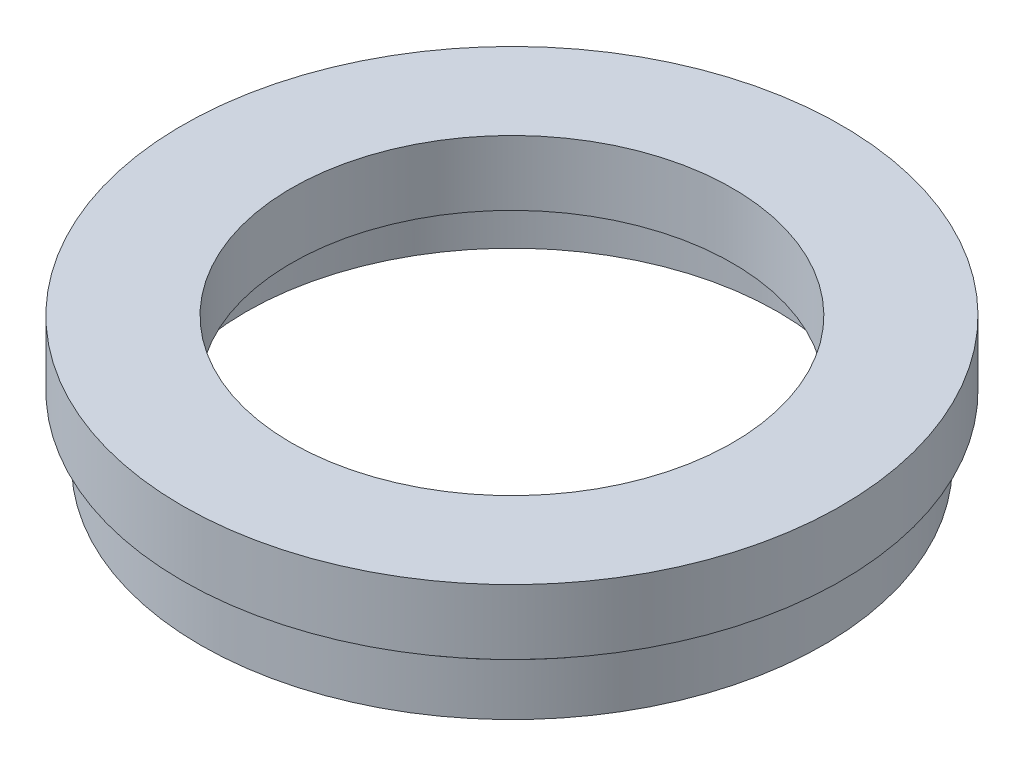
ISO-10303-21;
HEADER;
FILE_DESCRIPTION(('STEP AP214'),'2;1');
FILE_NAME('part.step','',(''),(''),'','','');
FILE_SCHEMA(('AUTOMOTIVE_DESIGN { 1 0 10303 214 1 1 1 1 }'));
ENDSEC;
DATA;
#1=APPLICATION_CONTEXT('core data for automotive mechanical design processes');
#2=APPLICATION_PROTOCOL_DEFINITION('international standard','automotive_design',2000,#1);
#3=PRODUCT_CONTEXT('',#1,'mechanical');
#4=PRODUCT('Part','Part','',(#3));
#5=PRODUCT_RELATED_PRODUCT_CATEGORY('part','',(#4));
#6=PRODUCT_DEFINITION_FORMATION('','',#4);
#7=PRODUCT_DEFINITION_CONTEXT('part definition',#1,'design');
#8=PRODUCT_DEFINITION('design','',#6,#7);
#9=PRODUCT_DEFINITION_SHAPE('','',#8);
#10=(LENGTH_UNIT() NAMED_UNIT(*) SI_UNIT(.MILLI.,.METRE.));
#11=(NAMED_UNIT(*) PLANE_ANGLE_UNIT() SI_UNIT($,.RADIAN.));
#12=(NAMED_UNIT(*) SI_UNIT($,.STERADIAN.) SOLID_ANGLE_UNIT());
#13=UNCERTAINTY_MEASURE_WITH_UNIT(LENGTH_MEASURE(1.E-05),#10,'distance_accuracy_value','');
#14=(GEOMETRIC_REPRESENTATION_CONTEXT(3) GLOBAL_UNCERTAINTY_ASSIGNED_CONTEXT((#13)) GLOBAL_UNIT_ASSIGNED_CONTEXT((#10,
#11,#12)) REPRESENTATION_CONTEXT('',''));
#15=CARTESIAN_POINT('',(0.,0.,0.));
#16=DIRECTION('',(0.,0.,1.));
#17=DIRECTION('',(1.,0.,0.));
#18=AXIS2_PLACEMENT_3D('',#15,#16,#17);
#19=CARTESIAN_POINT('',(20.5,0.,0.));
#20=DIRECTION('',(0.,1.,0.));
#21=DIRECTION('',(0.,0.,1.));
#22=AXIS2_PLACEMENT_3D('',#19,#20,#21);
#23=PLANE('',#22);
#24=CARTESIAN_POINT('',(0.,0.,0.));
#25=DIRECTION('',(0.,1.,0.));
#26=DIRECTION('',(0.,0.,1.));
#27=AXIS2_PLACEMENT_3D('',#24,#25,#26);
#28=CIRCLE('',#27,24.);
#29=CARTESIAN_POINT('',(0.,0.,24.));
#30=VERTEX_POINT('',#29);
#31=EDGE_CURVE('E10',#30,#30,#28,.T.);
#32=ORIENTED_EDGE('',*,*,#31,.F.);
#33=EDGE_LOOP('',(#32));
#34=FACE_BOUND('',#33,.T.);
#35=CARTESIAN_POINT('',(0.,0.,0.));
#36=DIRECTION('',(0.,1.,0.));
#37=DIRECTION('',(0.,0.,1.));
#38=AXIS2_PLACEMENT_3D('',#35,#36,#37);
#39=CIRCLE('',#38,20.5);
#40=CARTESIAN_POINT('',(0.,0.,20.5));
#41=VERTEX_POINT('',#40);
#42=EDGE_CURVE('E75',#41,#41,#39,.T.);
#43=ORIENTED_EDGE('',*,*,#42,.T.);
#44=EDGE_LOOP('',(#43));
#45=FACE_BOUND('',#44,.T.);
#46=ADVANCED_FACE('F35',(#34,#45),#23,.F.);
#47=CARTESIAN_POINT('',(0.,17.4192983181939,0.));
#48=DIRECTION('',(0.,1.,0.));
#49=DIRECTION('',(0.,0.,1.));
#50=AXIS2_PLACEMENT_3D('',#47,#48,#49);
#51=CYLINDRICAL_SURFACE('',#50,24.);
#52=CARTESIAN_POINT('',(0.,4.,0.));
#53=DIRECTION('',(0.,1.,0.));
#54=DIRECTION('',(0.,0.,1.));
#55=AXIS2_PLACEMENT_3D('',#52,#53,#54);
#56=CIRCLE('',#55,24.);
#57=CARTESIAN_POINT('',(0.,4.,24.));
#58=VERTEX_POINT('',#57);
#59=EDGE_CURVE('E41',#58,#58,#56,.T.);
#60=ORIENTED_EDGE('',*,*,#59,.F.);
#61=EDGE_LOOP('',(#60));
#62=FACE_BOUND('',#61,.T.);
#63=ORIENTED_EDGE('',*,*,#31,.T.);
#64=EDGE_LOOP('',(#63));
#65=FACE_BOUND('',#64,.T.);
#66=ADVANCED_FACE('F136',(#62,#65),#51,.T.);
#67=CARTESIAN_POINT('',(24.,4.,0.));
#68=DIRECTION('',(0.,-1.,0.));
#69=DIRECTION('',(0.,0.,-1.));
#70=AXIS2_PLACEMENT_3D('',#67,#68,#69);
#71=PLANE('',#70);
#72=CARTESIAN_POINT('',(0.,4.,0.));
#73=DIRECTION('',(0.,1.,0.));
#74=DIRECTION('',(0.,0.,1.));
#75=AXIS2_PLACEMENT_3D('',#72,#73,#74);
#76=CIRCLE('',#75,23.5);
#77=CARTESIAN_POINT('',(0.,4.,23.5));
#78=VERTEX_POINT('',#77);
#79=EDGE_CURVE('E45',#78,#78,#76,.T.);
#80=ORIENTED_EDGE('',*,*,#79,.F.);
#81=EDGE_LOOP('',(#80));
#82=FACE_BOUND('',#81,.T.);
#83=ORIENTED_EDGE('',*,*,#59,.T.);
#84=EDGE_LOOP('',(#83));
#85=FACE_BOUND('',#84,.T.);
#86=ADVANCED_FACE('F131',(#82,#85),#71,.F.);
#87=CARTESIAN_POINT('',(0.,17.4192983181939,0.));
#88=DIRECTION('',(0.,1.,0.));
#89=DIRECTION('',(0.,0.,1.));
#90=AXIS2_PLACEMENT_3D('',#87,#88,#89);
#91=CYLINDRICAL_SURFACE('',#90,23.5);
#92=CARTESIAN_POINT('',(0.,5.,0.));
#93=DIRECTION('',(0.,1.,0.));
#94=DIRECTION('',(0.,0.,1.));
#95=AXIS2_PLACEMENT_3D('',#92,#93,#94);
#96=CIRCLE('',#95,23.5);
#97=CARTESIAN_POINT('',(0.,5.,23.5));
#98=VERTEX_POINT('',#97);
#99=EDGE_CURVE('E49',#98,#98,#96,.T.);
#100=ORIENTED_EDGE('',*,*,#99,.F.);
#101=EDGE_LOOP('',(#100));
#102=FACE_BOUND('',#101,.T.);
#103=ORIENTED_EDGE('',*,*,#79,.T.);
#104=EDGE_LOOP('',(#103));
#105=FACE_BOUND('',#104,.T.);
#106=ADVANCED_FACE('F125',(#102,#105),#91,.T.);
#107=CARTESIAN_POINT('',(23.5,5.,0.));
#108=DIRECTION('',(0.,1.,0.));
#109=DIRECTION('',(0.,0.,1.));
#110=AXIS2_PLACEMENT_3D('',#107,#108,#109);
#111=PLANE('',#110);
#112=CARTESIAN_POINT('',(0.,5.,0.));
#113=DIRECTION('',(0.,1.,0.));
#114=DIRECTION('',(0.,0.,1.));
#115=AXIS2_PLACEMENT_3D('',#112,#113,#114);
#116=CIRCLE('',#115,25.4);
#117=CARTESIAN_POINT('',(0.,5.,25.4));
#118=VERTEX_POINT('',#117);
#119=EDGE_CURVE('E54',#118,#118,#116,.T.);
#120=ORIENTED_EDGE('',*,*,#119,.F.);
#121=EDGE_LOOP('',(#120));
#122=FACE_BOUND('',#121,.T.);
#123=ORIENTED_EDGE('',*,*,#99,.T.);
#124=EDGE_LOOP('',(#123));
#125=FACE_BOUND('',#124,.T.);
#126=ADVANCED_FACE('F119',(#122,#125),#111,.F.);
#127=CARTESIAN_POINT('',(0.,17.4192983181939,0.));
#128=DIRECTION('',(0.,1.,0.));
#129=DIRECTION('',(0.,0.,1.));
#130=AXIS2_PLACEMENT_3D('',#127,#128,#129);
#131=CYLINDRICAL_SURFACE('',#130,25.4);
#132=CARTESIAN_POINT('',(0.,10.,0.));
#133=DIRECTION('',(0.,1.,0.));
#134=DIRECTION('',(0.,0.,1.));
#135=AXIS2_PLACEMENT_3D('',#132,#133,#134);
#136=CIRCLE('',#135,25.4);
#137=CARTESIAN_POINT('',(0.,10.,25.4));
#138=VERTEX_POINT('',#137);
#139=EDGE_CURVE('E57',#138,#138,#136,.T.);
#140=ORIENTED_EDGE('',*,*,#139,.F.);
#141=EDGE_LOOP('',(#140));
#142=FACE_BOUND('',#141,.T.);
#143=ORIENTED_EDGE('',*,*,#119,.T.);
#144=EDGE_LOOP('',(#143));
#145=FACE_BOUND('',#144,.T.);
#146=ADVANCED_FACE('F113',(#142,#145),#131,.T.);
#147=CARTESIAN_POINT('',(17.,10.,0.));
#148=DIRECTION('',(0.,-1.,0.));
#149=DIRECTION('',(0.,0.,-1.));
#150=AXIS2_PLACEMENT_3D('',#147,#148,#149);
#151=PLANE('',#150);
#152=CARTESIAN_POINT('',(0.,10.,0.));
#153=DIRECTION('',(0.,1.,0.));
#154=DIRECTION('',(0.,0.,1.));
#155=AXIS2_PLACEMENT_3D('',#152,#153,#154);
#156=CIRCLE('',#155,17.);
#157=CARTESIAN_POINT('',(0.,10.,17.));
#158=VERTEX_POINT('',#157);
#159=EDGE_CURVE('E60',#158,#158,#156,.T.);
#160=ORIENTED_EDGE('',*,*,#159,.F.);
#161=EDGE_LOOP('',(#160));
#162=FACE_BOUND('',#161,.T.);
#163=ORIENTED_EDGE('',*,*,#139,.T.);
#164=EDGE_LOOP('',(#163));
#165=FACE_BOUND('',#164,.T.);
#166=ADVANCED_FACE('F107',(#162,#165),#151,.F.);
#167=CARTESIAN_POINT('',(0.,17.4192983181939,0.));
#168=DIRECTION('',(0.,1.,0.));
#169=DIRECTION('',(0.,0.,1.));
#170=AXIS2_PLACEMENT_3D('',#167,#168,#169);
#171=CYLINDRICAL_SURFACE('',#170,17.);
#172=CARTESIAN_POINT('',(0.,5.,0.));
#173=DIRECTION('',(0.,1.,0.));
#174=DIRECTION('',(0.,0.,1.));
#175=AXIS2_PLACEMENT_3D('',#172,#173,#174);
#176=CIRCLE('',#175,17.);
#177=CARTESIAN_POINT('',(0.,5.,17.));
#178=VERTEX_POINT('',#177);
#179=EDGE_CURVE('E63',#178,#178,#176,.T.);
#180=ORIENTED_EDGE('',*,*,#179,.F.);
#181=EDGE_LOOP('',(#180));
#182=FACE_BOUND('',#181,.T.);
#183=ORIENTED_EDGE('',*,*,#159,.T.);
#184=EDGE_LOOP('',(#183));
#185=FACE_BOUND('',#184,.T.);
#186=ADVANCED_FACE('F101',(#182,#185),#171,.F.);
#187=CARTESIAN_POINT('',(21.1,5.,0.));
#188=DIRECTION('',(0.,1.,0.));
#189=DIRECTION('',(0.,0.,1.));
#190=AXIS2_PLACEMENT_3D('',#187,#188,#189);
#191=PLANE('',#190);
#192=CARTESIAN_POINT('',(0.,5.,0.));
#193=DIRECTION('',(0.,1.,0.));
#194=DIRECTION('',(0.,0.,1.));
#195=AXIS2_PLACEMENT_3D('',#192,#193,#194);
#196=CIRCLE('',#195,21.1);
#197=CARTESIAN_POINT('',(0.,5.,21.1));
#198=VERTEX_POINT('',#197);
#199=EDGE_CURVE('E66',#198,#198,#196,.T.);
#200=ORIENTED_EDGE('',*,*,#199,.F.);
#201=EDGE_LOOP('',(#200));
#202=FACE_BOUND('',#201,.T.);
#203=ORIENTED_EDGE('',*,*,#179,.T.);
#204=EDGE_LOOP('',(#203));
#205=FACE_BOUND('',#204,.T.);
#206=ADVANCED_FACE('F95',(#202,#205),#191,.F.);
#207=CARTESIAN_POINT('',(0.,17.4192983181939,0.));
#208=DIRECTION('',(0.,1.,0.));
#209=DIRECTION('',(0.,0.,1.));
#210=AXIS2_PLACEMENT_3D('',#207,#208,#209);
#211=CYLINDRICAL_SURFACE('',#210,21.1);
#212=CARTESIAN_POINT('',(0.,4.,0.));
#213=DIRECTION('',(0.,1.,0.));
#214=DIRECTION('',(0.,0.,1.));
#215=AXIS2_PLACEMENT_3D('',#212,#213,#214);
#216=CIRCLE('',#215,21.1);
#217=CARTESIAN_POINT('',(0.,4.,21.1));
#218=VERTEX_POINT('',#217);
#219=EDGE_CURVE('E69',#218,#218,#216,.T.);
#220=ORIENTED_EDGE('',*,*,#219,.F.);
#221=EDGE_LOOP('',(#220));
#222=FACE_BOUND('',#221,.T.);
#223=ORIENTED_EDGE('',*,*,#199,.T.);
#224=EDGE_LOOP('',(#223));
#225=FACE_BOUND('',#224,.T.);
#226=ADVANCED_FACE('F89',(#222,#225),#211,.F.);
#227=CARTESIAN_POINT('',(20.5,4.,0.));
#228=DIRECTION('',(0.,-1.,0.));
#229=DIRECTION('',(0.,0.,-1.));
#230=AXIS2_PLACEMENT_3D('',#227,#228,#229);
#231=PLANE('',#230);
#232=CARTESIAN_POINT('',(0.,4.,0.));
#233=DIRECTION('',(0.,1.,0.));
#234=DIRECTION('',(0.,0.,1.));
#235=AXIS2_PLACEMENT_3D('',#232,#233,#234);
#236=CIRCLE('',#235,20.5);
#237=CARTESIAN_POINT('',(0.,4.,20.5));
#238=VERTEX_POINT('',#237);
#239=EDGE_CURVE('E72',#238,#238,#236,.T.);
#240=ORIENTED_EDGE('',*,*,#239,.F.);
#241=EDGE_LOOP('',(#240));
#242=FACE_BOUND('',#241,.T.);
#243=ORIENTED_EDGE('',*,*,#219,.T.);
#244=EDGE_LOOP('',(#243));
#245=FACE_BOUND('',#244,.T.);
#246=ADVANCED_FACE('F83',(#242,#245),#231,.F.);
#247=CARTESIAN_POINT('',(0.,17.4192983181939,0.));
#248=DIRECTION('',(0.,1.,0.));
#249=DIRECTION('',(0.,0.,1.));
#250=AXIS2_PLACEMENT_3D('',#247,#248,#249);
#251=CYLINDRICAL_SURFACE('',#250,20.5);
#252=ORIENTED_EDGE('',*,*,#42,.F.);
#253=EDGE_LOOP('',(#252));
#254=FACE_BOUND('',#253,.T.);
#255=ORIENTED_EDGE('',*,*,#239,.T.);
#256=EDGE_LOOP('',(#255));
#257=FACE_BOUND('',#256,.T.);
#258=ADVANCED_FACE('F80',(#254,#257),#251,.F.);
#259=CLOSED_SHELL('',(#46,#66,#86,#106,#126,#146,#166,#186,#206,#226,#246,#258));
#260=MANIFOLD_SOLID_BREP('B2',#259);
#261=ADVANCED_BREP_SHAPE_REPRESENTATION('',(#18,#260),#14);
#262=SHAPE_DEFINITION_REPRESENTATION(#9,#261);
ENDSEC;
END-ISO-10303-21;
